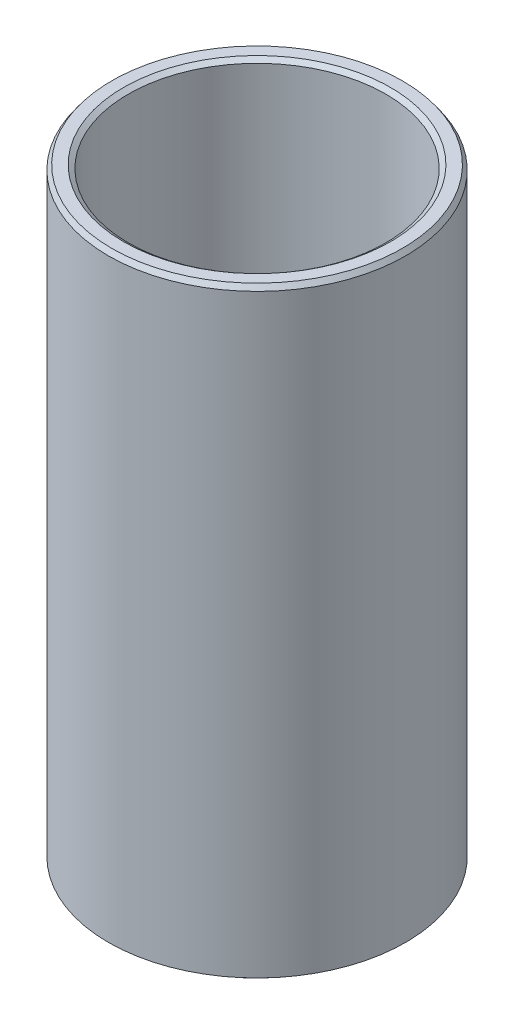
ISO-10303-21;
HEADER;
FILE_DESCRIPTION(('STEP AP214'),'2;1');
FILE_NAME('part.step','',(''),(''),'','','');
FILE_SCHEMA(('AUTOMOTIVE_DESIGN { 1 0 10303 214 1 1 1 1 }'));
ENDSEC;
DATA;
#1=APPLICATION_CONTEXT('core data for automotive mechanical design processes');
#2=APPLICATION_PROTOCOL_DEFINITION('international standard','automotive_design',2000,#1);
#3=PRODUCT_CONTEXT('',#1,'mechanical');
#4=PRODUCT('Part','Part','',(#3));
#5=PRODUCT_RELATED_PRODUCT_CATEGORY('part','',(#4));
#6=PRODUCT_DEFINITION_FORMATION('','',#4);
#7=PRODUCT_DEFINITION_CONTEXT('part definition',#1,'design');
#8=PRODUCT_DEFINITION('design','',#6,#7);
#9=PRODUCT_DEFINITION_SHAPE('','',#8);
#10=(LENGTH_UNIT() NAMED_UNIT(*) SI_UNIT(.MILLI.,.METRE.));
#11=(NAMED_UNIT(*) PLANE_ANGLE_UNIT() SI_UNIT($,.RADIAN.));
#12=(NAMED_UNIT(*) SI_UNIT($,.STERADIAN.) SOLID_ANGLE_UNIT());
#13=UNCERTAINTY_MEASURE_WITH_UNIT(LENGTH_MEASURE(1.E-05),#10,'distance_accuracy_value','');
#14=(GEOMETRIC_REPRESENTATION_CONTEXT(3) GLOBAL_UNCERTAINTY_ASSIGNED_CONTEXT((#13)) GLOBAL_UNIT_ASSIGNED_CONTEXT((#10,
#11,#12)) REPRESENTATION_CONTEXT('',''));
#15=CARTESIAN_POINT('',(0.,0.,0.));
#16=DIRECTION('',(0.,0.,1.));
#17=DIRECTION('',(1.,0.,0.));
#18=AXIS2_PLACEMENT_3D('',#15,#16,#17);
#19=CARTESIAN_POINT('',(0.,202.75644467695,0.));
#20=DIRECTION('',(0.,-1.,0.));
#21=DIRECTION('',(0.,0.,-1.));
#22=AXIS2_PLACEMENT_3D('',#19,#20,#21);
#23=CYLINDRICAL_SURFACE('',#22,50.);
#24=CARTESIAN_POINT('',(0.,1.1379977515962,0.));
#25=DIRECTION('',(0.,1.,0.));
#26=DIRECTION('',(0.,0.,1.));
#27=AXIS2_PLACEMENT_3D('',#24,#25,#26);
#28=CIRCLE('',#27,50.);
#29=CARTESIAN_POINT('',(0.,1.1379977515962,50.));
#30=VERTEX_POINT('',#29);
#31=EDGE_CURVE('E10',#30,#30,#28,.T.);
#32=ORIENTED_EDGE('',*,*,#31,.T.);
#33=EDGE_LOOP('',(#32));
#34=FACE_BOUND('',#33,.T.);
#35=CARTESIAN_POINT('',(0.,201.155893500818,0.));
#36=DIRECTION('',(0.,1.,0.));
#37=DIRECTION('',(0.,0.,1.));
#38=AXIS2_PLACEMENT_3D('',#35,#36,#37);
#39=CIRCLE('',#38,50.);
#40=CARTESIAN_POINT('',(0.,201.155893500818,50.));
#41=VERTEX_POINT('',#40);
#42=EDGE_CURVE('E50',#41,#41,#39,.F.);
#43=ORIENTED_EDGE('',*,*,#42,.T.);
#44=EDGE_LOOP('',(#43));
#45=FACE_BOUND('',#44,.T.);
#46=ADVANCED_FACE('F39',(#34,#45),#23,.T.);
#47=CARTESIAN_POINT('',(0.,202.75644467695,0.));
#48=DIRECTION('',(0.,1.,0.));
#49=DIRECTION('',(0.,0.,1.));
#50=AXIS2_PLACEMENT_3D('',#47,#48,#49);
#51=PLANE('',#50);
#52=CARTESIAN_POINT('',(0.,202.75644467695,0.));
#53=DIRECTION('',(0.,1.,0.));
#54=DIRECTION('',(0.,0.,1.));
#55=AXIS2_PLACEMENT_3D('',#52,#53,#54);
#56=CIRCLE('',#55,44.9356042347416);
#57=CARTESIAN_POINT('',(0.,202.75644467695,44.9356042347416));
#58=VERTEX_POINT('',#57);
#59=EDGE_CURVE('E58',#58,#58,#56,.F.);
#60=ORIENTED_EDGE('',*,*,#59,.T.);
#61=EDGE_LOOP('',(#60));
#62=FACE_BOUND('',#61,.T.);
#63=CARTESIAN_POINT('',(0.,202.75644467695,0.));
#64=DIRECTION('',(0.,1.,0.));
#65=DIRECTION('',(0.,0.,1.));
#66=AXIS2_PLACEMENT_3D('',#63,#64,#65);
#67=CIRCLE('',#66,48.8620022484037);
#68=CARTESIAN_POINT('',(0.,202.75644467695,48.8620022484037));
#69=VERTEX_POINT('',#68);
#70=EDGE_CURVE('E61',#69,#69,#67,.T.);
#71=ORIENTED_EDGE('',*,*,#70,.T.);
#72=EDGE_LOOP('',(#71));
#73=FACE_BOUND('',#72,.T.);
#74=ADVANCED_FACE('F88',(#62,#73),#51,.T.);
#75=CARTESIAN_POINT('',(0.,0.,0.));
#76=DIRECTION('',(0.,1.,0.));
#77=DIRECTION('',(0.,0.,1.));
#78=AXIS2_PLACEMENT_3D('',#75,#76,#77);
#79=PLANE('',#78);
#80=CARTESIAN_POINT('',(0.,0.,0.));
#81=DIRECTION('',(0.,1.,0.));
#82=DIRECTION('',(0.,0.,1.));
#83=AXIS2_PLACEMENT_3D('',#80,#81,#82);
#84=CIRCLE('',#83,44.4730508102063);
#85=CARTESIAN_POINT('',(0.,0.,44.4730508102063));
#86=VERTEX_POINT('',#85);
#87=EDGE_CURVE('E51',#86,#86,#84,.T.);
#88=ORIENTED_EDGE('',*,*,#87,.T.);
#89=EDGE_LOOP('',(#88));
#90=FACE_BOUND('',#89,.T.);
#91=CARTESIAN_POINT('',(0.,0.,0.));
#92=DIRECTION('',(0.,1.,0.));
#93=DIRECTION('',(0.,0.,1.));
#94=AXIS2_PLACEMENT_3D('',#91,#92,#93);
#95=CIRCLE('',#94,48.3994488238684);
#96=CARTESIAN_POINT('',(0.,0.,48.3994488238684));
#97=VERTEX_POINT('',#96);
#98=EDGE_CURVE('E54',#97,#97,#95,.F.);
#99=ORIENTED_EDGE('',*,*,#98,.T.);
#100=EDGE_LOOP('',(#99));
#101=FACE_BOUND('',#100,.T.);
#102=ADVANCED_FACE('F83',(#90,#101),#79,.F.);
#103=CARTESIAN_POINT('',(0.,202.75644467695,0.));
#104=DIRECTION('',(0.,-1.,0.));
#105=DIRECTION('',(0.,0.,-1.));
#106=AXIS2_PLACEMENT_3D('',#103,#104,#105);
#107=CYLINDRICAL_SURFACE('',#106,43.33505305861);
#108=CARTESIAN_POINT('',(0.,201.618446925353,0.));
#109=DIRECTION('',(0.,1.,0.));
#110=DIRECTION('',(0.,0.,1.));
#111=AXIS2_PLACEMENT_3D('',#108,#109,#110);
#112=CIRCLE('',#111,43.33505305861);
#113=CARTESIAN_POINT('',(0.,201.618446925353,43.33505305861));
#114=VERTEX_POINT('',#113);
#115=EDGE_CURVE('E67',#114,#114,#112,.T.);
#116=ORIENTED_EDGE('',*,*,#115,.T.);
#117=EDGE_LOOP('',(#116));
#118=FACE_BOUND('',#117,.T.);
#119=CARTESIAN_POINT('',(0.,1.60055117613164,0.));
#120=DIRECTION('',(0.,1.,0.));
#121=DIRECTION('',(0.,0.,1.));
#122=AXIS2_PLACEMENT_3D('',#119,#120,#121);
#123=CIRCLE('',#122,43.33505305861);
#124=CARTESIAN_POINT('',(0.,1.60055117613164,43.33505305861));
#125=VERTEX_POINT('',#124);
#126=EDGE_CURVE('E69',#125,#125,#123,.F.);
#127=ORIENTED_EDGE('',*,*,#126,.T.);
#128=EDGE_LOOP('',(#127));
#129=FACE_BOUND('',#128,.T.);
#130=ADVANCED_FACE('F71',(#118,#129),#107,.F.);
#131=CARTESIAN_POINT('',(0.,201.618446925353,0.));
#132=DIRECTION('',(0.,1.,0.));
#133=DIRECTION('',(0.,0.,1.));
#134=AXIS2_PLACEMENT_3D('',#131,#132,#133);
#135=CONICAL_SURFACE('',#134,43.33505305861,0.952723465321184);
#136=ORIENTED_EDGE('',*,*,#59,.F.);
#137=EDGE_LOOP('',(#136));
#138=FACE_BOUND('',#137,.T.);
#139=ORIENTED_EDGE('',*,*,#115,.F.);
#140=EDGE_LOOP('',(#139));
#141=FACE_BOUND('',#140,.T.);
#142=ADVANCED_FACE('F77',(#138,#141),#135,.F.);
#143=CARTESIAN_POINT('',(0.,0.,0.));
#144=DIRECTION('',(0.,-1.,0.));
#145=DIRECTION('',(0.,0.,-1.));
#146=AXIS2_PLACEMENT_3D('',#143,#144,#145);
#147=CONICAL_SURFACE('',#146,44.4730508102063,0.618072861473701);
#148=ORIENTED_EDGE('',*,*,#126,.F.);
#149=EDGE_LOOP('',(#148));
#150=FACE_BOUND('',#149,.T.);
#151=ORIENTED_EDGE('',*,*,#87,.F.);
#152=EDGE_LOOP('',(#151));
#153=FACE_BOUND('',#152,.T.);
#154=ADVANCED_FACE('F73',(#150,#153),#147,.F.);
#155=CARTESIAN_POINT('',(0.,1.1379977515962,0.));
#156=DIRECTION('',(0.,1.,0.));
#157=DIRECTION('',(0.,0.,1.));
#158=AXIS2_PLACEMENT_3D('',#155,#156,#157);
#159=CONICAL_SURFACE('',#158,50.,0.9527234653212);
#160=ORIENTED_EDGE('',*,*,#98,.F.);
#161=EDGE_LOOP('',(#160));
#162=FACE_BOUND('',#161,.T.);
#163=ORIENTED_EDGE('',*,*,#31,.F.);
#164=EDGE_LOOP('',(#163));
#165=FACE_BOUND('',#164,.T.);
#166=ADVANCED_FACE('F76',(#162,#165),#159,.T.);
#167=CARTESIAN_POINT('',(0.,202.75644467695,0.));
#168=DIRECTION('',(0.,-1.,0.));
#169=DIRECTION('',(0.,0.,-1.));
#170=AXIS2_PLACEMENT_3D('',#167,#168,#169);
#171=CONICAL_SURFACE('',#170,48.8620022484037,0.618072861473689);
#172=ORIENTED_EDGE('',*,*,#42,.F.);
#173=EDGE_LOOP('',(#172));
#174=FACE_BOUND('',#173,.T.);
#175=ORIENTED_EDGE('',*,*,#70,.F.);
#176=EDGE_LOOP('',(#175));
#177=FACE_BOUND('',#176,.T.);
#178=ADVANCED_FACE('F45',(#174,#177),#171,.T.);
#179=CLOSED_SHELL('',(#46,#74,#102,#130,#142,#154,#166,#178));
#180=MANIFOLD_SOLID_BREP('B2',#179);
#181=ADVANCED_BREP_SHAPE_REPRESENTATION('',(#18,#180),#14);
#182=SHAPE_DEFINITION_REPRESENTATION(#9,#181);
ENDSEC;
END-ISO-10303-21;
